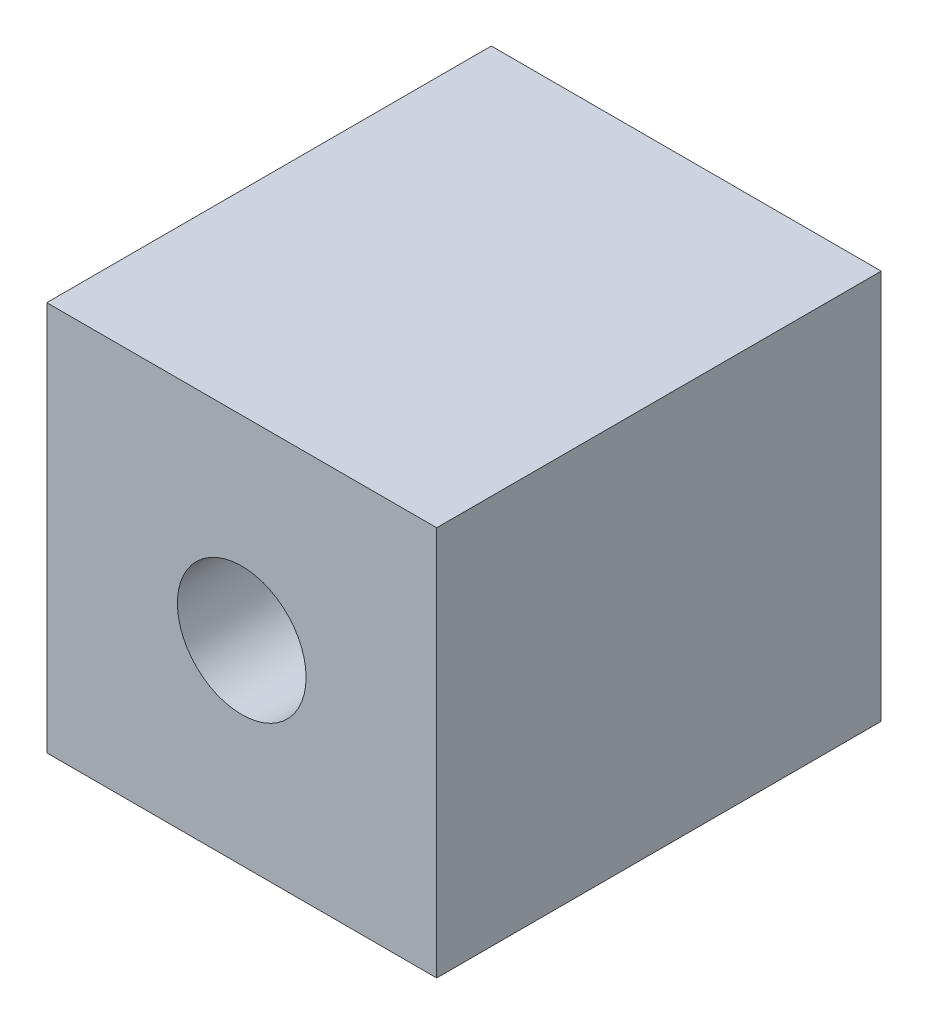
ISO-10303-21;
HEADER;
FILE_DESCRIPTION(('STEP AP214'),'2;1');
FILE_NAME('part.step','',(''),(''),'','','');
FILE_SCHEMA(('AUTOMOTIVE_DESIGN { 1 0 10303 214 1 1 1 1 }'));
ENDSEC;
DATA;
#1=APPLICATION_CONTEXT('core data for automotive mechanical design processes');
#2=APPLICATION_PROTOCOL_DEFINITION('international standard','automotive_design',2000,#1);
#3=PRODUCT_CONTEXT('',#1,'mechanical');
#4=PRODUCT('Part','Part','',(#3));
#5=PRODUCT_RELATED_PRODUCT_CATEGORY('part','',(#4));
#6=PRODUCT_DEFINITION_FORMATION('','',#4);
#7=PRODUCT_DEFINITION_CONTEXT('part definition',#1,'design');
#8=PRODUCT_DEFINITION('design','',#6,#7);
#9=PRODUCT_DEFINITION_SHAPE('','',#8);
#10=(LENGTH_UNIT() NAMED_UNIT(*) SI_UNIT(.MILLI.,.METRE.));
#11=(NAMED_UNIT(*) PLANE_ANGLE_UNIT() SI_UNIT($,.RADIAN.));
#12=(NAMED_UNIT(*) SI_UNIT($,.STERADIAN.) SOLID_ANGLE_UNIT());
#13=UNCERTAINTY_MEASURE_WITH_UNIT(LENGTH_MEASURE(1.E-05),#10,'distance_accuracy_value','');
#14=(GEOMETRIC_REPRESENTATION_CONTEXT(3) GLOBAL_UNCERTAINTY_ASSIGNED_CONTEXT((#13)) GLOBAL_UNIT_ASSIGNED_CONTEXT((#10,
#11,#12)) REPRESENTATION_CONTEXT('',''));
#15=CARTESIAN_POINT('',(0.,0.,0.));
#16=DIRECTION('',(0.,0.,1.));
#17=DIRECTION('',(1.,0.,0.));
#18=AXIS2_PLACEMENT_3D('',#15,#16,#17);
#19=CARTESIAN_POINT('',(0.,0.,11.4));
#20=DIRECTION('',(1.,0.,0.));
#21=DIRECTION('',(0.,0.,-1.));
#22=AXIS2_PLACEMENT_3D('',#19,#20,#21);
#23=PLANE('',#22);
#24=DIRECTION('',(0.,-1.,0.));
#25=VECTOR('',#24,1.);
#26=CARTESIAN_POINT('',(0.,0.,0.));
#27=LINE('',#26,#25);
#28=CARTESIAN_POINT('',(0.,10.,0.));
#29=VERTEX_POINT('',#28);
#30=CARTESIAN_POINT('',(0.,0.,0.));
#31=VERTEX_POINT('',#30);
#32=EDGE_CURVE('E100',#29,#31,#27,.T.);
#33=ORIENTED_EDGE('',*,*,#32,.T.);
#34=DIRECTION('',(0.,0.,-1.));
#35=VECTOR('',#34,1.);
#36=CARTESIAN_POINT('',(0.,0.,11.4));
#37=LINE('',#36,#35);
#38=CARTESIAN_POINT('',(0.,0.,11.4));
#39=VERTEX_POINT('',#38);
#40=EDGE_CURVE('E11',#39,#31,#37,.T.);
#41=ORIENTED_EDGE('',*,*,#40,.F.);
#42=DIRECTION('',(0.,-1.,0.));
#43=VECTOR('',#42,1.);
#44=CARTESIAN_POINT('',(0.,0.,11.4));
#45=LINE('',#44,#43);
#46=CARTESIAN_POINT('',(0.,10.,11.4));
#47=VERTEX_POINT('',#46);
#48=EDGE_CURVE('E88',#47,#39,#45,.T.);
#49=ORIENTED_EDGE('',*,*,#48,.F.);
#50=DIRECTION('',(0.,0.,-1.));
#51=VECTOR('',#50,1.);
#52=CARTESIAN_POINT('',(0.,10.,11.4));
#53=LINE('',#52,#51);
#54=EDGE_CURVE('E96',#47,#29,#53,.T.);
#55=ORIENTED_EDGE('',*,*,#54,.T.);
#56=EDGE_LOOP('',(#33,#41,#49,#55));
#57=FACE_BOUND('',#56,.T.);
#58=ADVANCED_FACE('F37',(#57),#23,.F.);
#59=CARTESIAN_POINT('',(0.,0.,11.4));
#60=DIRECTION('',(0.,1.,0.));
#61=DIRECTION('',(0.,0.,1.));
#62=AXIS2_PLACEMENT_3D('',#59,#60,#61);
#63=PLANE('',#62);
#64=DIRECTION('',(1.,0.,0.));
#65=VECTOR('',#64,1.);
#66=CARTESIAN_POINT('',(0.,0.,0.));
#67=LINE('',#66,#65);
#68=CARTESIAN_POINT('',(10.,0.,0.));
#69=VERTEX_POINT('',#68);
#70=EDGE_CURVE('E92',#31,#69,#67,.T.);
#71=ORIENTED_EDGE('',*,*,#70,.T.);
#72=DIRECTION('',(0.,0.,-1.));
#73=VECTOR('',#72,1.);
#74=CARTESIAN_POINT('',(10.,0.,11.4));
#75=LINE('',#74,#73);
#76=CARTESIAN_POINT('',(10.,0.,11.4));
#77=VERTEX_POINT('',#76);
#78=EDGE_CURVE('E45',#77,#69,#75,.T.);
#79=ORIENTED_EDGE('',*,*,#78,.F.);
#80=DIRECTION('',(1.,0.,0.));
#81=VECTOR('',#80,1.);
#82=CARTESIAN_POINT('',(0.,0.,11.4));
#83=LINE('',#82,#81);
#84=EDGE_CURVE('E83',#39,#77,#83,.T.);
#85=ORIENTED_EDGE('',*,*,#84,.F.);
#86=ORIENTED_EDGE('',*,*,#40,.T.);
#87=EDGE_LOOP('',(#71,#79,#85,#86));
#88=FACE_BOUND('',#87,.T.);
#89=ADVANCED_FACE('F91',(#88),#63,.F.);
#90=CARTESIAN_POINT('',(10.,0.,11.4));
#91=DIRECTION('',(-1.,0.,0.));
#92=DIRECTION('',(0.,0.,1.));
#93=AXIS2_PLACEMENT_3D('',#90,#91,#92);
#94=PLANE('',#93);
#95=DIRECTION('',(0.,1.,0.));
#96=VECTOR('',#95,1.);
#97=CARTESIAN_POINT('',(10.,0.,0.));
#98=LINE('',#97,#96);
#99=CARTESIAN_POINT('',(10.,10.,0.));
#100=VERTEX_POINT('',#99);
#101=EDGE_CURVE('E70',#69,#100,#98,.T.);
#102=ORIENTED_EDGE('',*,*,#101,.T.);
#103=DIRECTION('',(0.,0.,-1.));
#104=VECTOR('',#103,1.);
#105=CARTESIAN_POINT('',(10.,10.,11.4));
#106=LINE('',#105,#104);
#107=CARTESIAN_POINT('',(10.,10.,11.4));
#108=VERTEX_POINT('',#107);
#109=EDGE_CURVE('E93',#108,#100,#106,.T.);
#110=ORIENTED_EDGE('',*,*,#109,.F.);
#111=DIRECTION('',(0.,1.,0.));
#112=VECTOR('',#111,1.);
#113=CARTESIAN_POINT('',(10.,0.,11.4));
#114=LINE('',#113,#112);
#115=EDGE_CURVE('E86',#77,#108,#114,.T.);
#116=ORIENTED_EDGE('',*,*,#115,.F.);
#117=ORIENTED_EDGE('',*,*,#78,.T.);
#118=EDGE_LOOP('',(#102,#110,#116,#117));
#119=FACE_BOUND('',#118,.T.);
#120=ADVANCED_FACE('F94',(#119),#94,.F.);
#121=CARTESIAN_POINT('',(0.,10.,11.4));
#122=DIRECTION('',(0.,-1.,0.));
#123=DIRECTION('',(0.,0.,-1.));
#124=AXIS2_PLACEMENT_3D('',#121,#122,#123);
#125=PLANE('',#124);
#126=DIRECTION('',(-1.,0.,0.));
#127=VECTOR('',#126,1.);
#128=CARTESIAN_POINT('',(0.,10.,0.));
#129=LINE('',#128,#127);
#130=EDGE_CURVE('E76',#100,#29,#129,.T.);
#131=ORIENTED_EDGE('',*,*,#130,.T.);
#132=ORIENTED_EDGE('',*,*,#54,.F.);
#133=DIRECTION('',(-1.,0.,0.));
#134=VECTOR('',#133,1.);
#135=CARTESIAN_POINT('',(0.,10.,11.4));
#136=LINE('',#135,#134);
#137=EDGE_CURVE('E53',#108,#47,#136,.T.);
#138=ORIENTED_EDGE('',*,*,#137,.F.);
#139=ORIENTED_EDGE('',*,*,#109,.T.);
#140=EDGE_LOOP('',(#131,#132,#138,#139));
#141=FACE_BOUND('',#140,.T.);
#142=ADVANCED_FACE('F108',(#141),#125,.F.);
#143=CARTESIAN_POINT('',(0.,0.,11.4));
#144=DIRECTION('',(0.,0.,-1.));
#145=DIRECTION('',(-1.,0.,0.));
#146=AXIS2_PLACEMENT_3D('',#143,#144,#145);
#147=PLANE('',#146);
#148=CARTESIAN_POINT('',(5.,5.,11.4));
#149=DIRECTION('',(0.,0.,1.));
#150=DIRECTION('',(1.,0.,0.));
#151=AXIS2_PLACEMENT_3D('',#148,#149,#150);
#152=CIRCLE('',#151,1.64999999999999);
#153=CARTESIAN_POINT('',(6.64999999999999,5.,11.4));
#154=VERTEX_POINT('',#153);
#155=EDGE_CURVE('E116',#154,#154,#152,.T.);
#156=ORIENTED_EDGE('',*,*,#155,.F.);
#157=EDGE_LOOP('',(#156));
#158=FACE_BOUND('',#157,.T.);
#159=ORIENTED_EDGE('',*,*,#48,.T.);
#160=ORIENTED_EDGE('',*,*,#84,.T.);
#161=ORIENTED_EDGE('',*,*,#115,.T.);
#162=ORIENTED_EDGE('',*,*,#137,.T.);
#163=EDGE_LOOP('',(#159,#160,#161,#162));
#164=FACE_BOUND('',#163,.T.);
#165=ADVANCED_FACE('F84',(#158,#164),#147,.F.);
#166=CARTESIAN_POINT('',(0.,0.,0.));
#167=DIRECTION('',(0.,0.,-1.));
#168=DIRECTION('',(-1.,0.,0.));
#169=AXIS2_PLACEMENT_3D('',#166,#167,#168);
#170=PLANE('',#169);
#171=CARTESIAN_POINT('',(5.,5.,0.));
#172=DIRECTION('',(0.,0.,1.));
#173=DIRECTION('',(1.,0.,0.));
#174=AXIS2_PLACEMENT_3D('',#171,#172,#173);
#175=CIRCLE('',#174,1.65);
#176=CARTESIAN_POINT('',(6.65,5.,0.));
#177=VERTEX_POINT('',#176);
#178=EDGE_CURVE('E103',#177,#177,#175,.T.);
#179=ORIENTED_EDGE('',*,*,#178,.T.);
#180=EDGE_LOOP('',(#179));
#181=FACE_BOUND('',#180,.T.);
#182=ORIENTED_EDGE('',*,*,#32,.F.);
#183=ORIENTED_EDGE('',*,*,#130,.F.);
#184=ORIENTED_EDGE('',*,*,#101,.F.);
#185=ORIENTED_EDGE('',*,*,#70,.F.);
#186=EDGE_LOOP('',(#182,#183,#184,#185));
#187=FACE_BOUND('',#186,.T.);
#188=ADVANCED_FACE('F111',(#181,#187),#170,.T.);
#189=CARTESIAN_POINT('',(5.,5.,11.4));
#190=DIRECTION('',(0.,0.,1.));
#191=DIRECTION('',(1.,0.,0.));
#192=AXIS2_PLACEMENT_3D('',#189,#190,#191);
#193=CYLINDRICAL_SURFACE('',#192,1.64999999999999);
#194=ORIENTED_EDGE('',*,*,#178,.F.);
#195=EDGE_LOOP('',(#194));
#196=FACE_BOUND('',#195,.T.);
#197=ORIENTED_EDGE('',*,*,#155,.T.);
#198=EDGE_LOOP('',(#197));
#199=FACE_BOUND('',#198,.T.);
#200=ADVANCED_FACE('F120',(#196,#199),#193,.F.);
#201=CLOSED_SHELL('',(#58,#89,#120,#142,#165,#188,#200));
#202=MANIFOLD_SOLID_BREP('B2',#201);
#203=ADVANCED_BREP_SHAPE_REPRESENTATION('',(#18,#202),#14);
#204=SHAPE_DEFINITION_REPRESENTATION(#9,#203);
ENDSEC;
END-ISO-10303-21;
